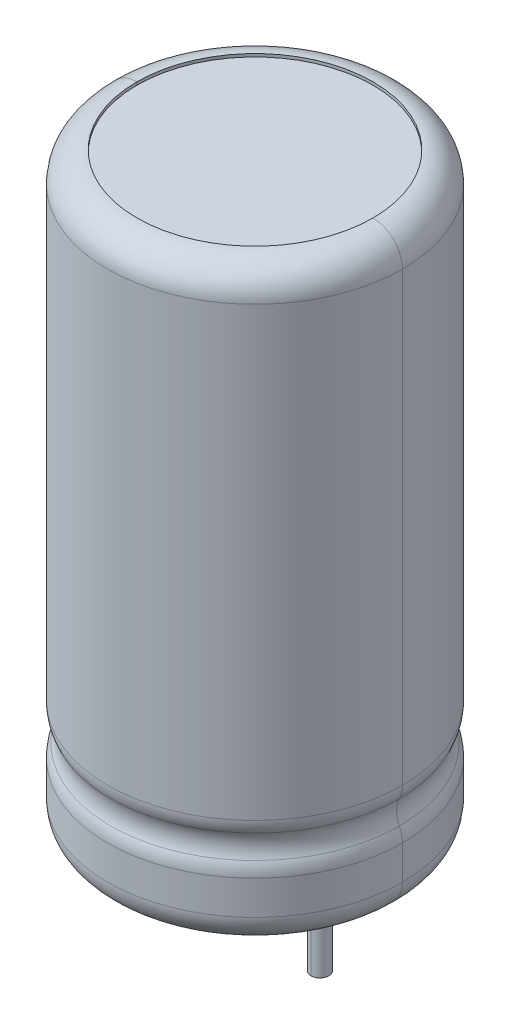
ISO-10303-21;
HEADER;
FILE_DESCRIPTION(('STEP AP214'),'2;1');
FILE_NAME('part.step','',(''),(''),'','','');
FILE_SCHEMA(('AUTOMOTIVE_DESIGN { 1 0 10303 214 1 1 1 1 }'));
ENDSEC;
DATA;
#1=APPLICATION_CONTEXT('core data for automotive mechanical design processes');
#2=APPLICATION_PROTOCOL_DEFINITION('international standard','automotive_design',2000,#1);
#3=PRODUCT_CONTEXT('',#1,'mechanical');
#4=PRODUCT('Part','Part','',(#3));
#5=PRODUCT_RELATED_PRODUCT_CATEGORY('part','',(#4));
#6=PRODUCT_DEFINITION_FORMATION('','',#4);
#7=PRODUCT_DEFINITION_CONTEXT('part definition',#1,'design');
#8=PRODUCT_DEFINITION('design','',#6,#7);
#9=PRODUCT_DEFINITION_SHAPE('','',#8);
#10=(LENGTH_UNIT() NAMED_UNIT(*) SI_UNIT(.MILLI.,.METRE.));
#11=(NAMED_UNIT(*) PLANE_ANGLE_UNIT() SI_UNIT($,.RADIAN.));
#12=(NAMED_UNIT(*) SI_UNIT($,.STERADIAN.) SOLID_ANGLE_UNIT());
#13=UNCERTAINTY_MEASURE_WITH_UNIT(LENGTH_MEASURE(1.E-05),#10,'distance_accuracy_value','');
#14=(GEOMETRIC_REPRESENTATION_CONTEXT(3) GLOBAL_UNCERTAINTY_ASSIGNED_CONTEXT((#13)) GLOBAL_UNIT_ASSIGNED_CONTEXT((#10,
#11,#12)) REPRESENTATION_CONTEXT('',''));
#15=CARTESIAN_POINT('',(0.,0.,0.));
#16=DIRECTION('',(0.,0.,1.));
#17=DIRECTION('',(1.,0.,0.));
#18=AXIS2_PLACEMENT_3D('',#15,#16,#17);
#19=CARTESIAN_POINT('',(2.2,0.,0.));
#20=DIRECTION('',(0.,-1.,0.));
#21=DIRECTION('',(0.,0.,1.));
#22=AXIS2_PLACEMENT_3D('',#19,#20,#21);
#23=CYLINDRICAL_SURFACE('',#22,0.3);
#24=CARTESIAN_POINT('',(2.2,-3.,0.));
#25=DIRECTION('',(0.,-1.,0.));
#26=DIRECTION('',(0.,0.,-1.));
#27=AXIS2_PLACEMENT_3D('',#24,#25,#26);
#28=CIRCLE('',#27,0.3);
#29=CARTESIAN_POINT('',(2.2,-3.,-0.3));
#30=VERTEX_POINT('',#29);
#31=CARTESIAN_POINT('',(2.2,-3.,0.3));
#32=VERTEX_POINT('',#31);
#33=EDGE_CURVE('E249',#30,#32,#28,.T.);
#34=ORIENTED_EDGE('',*,*,#33,.F.);
#35=DIRECTION('',(0.,-1.,0.));
#36=VECTOR('',#35,1.);
#37=CARTESIAN_POINT('',(2.2,0.,-0.3));
#38=LINE('',#37,#36);
#39=CARTESIAN_POINT('',(2.2,0.,-0.3));
#40=VERTEX_POINT('',#39);
#41=EDGE_CURVE('E11',#40,#30,#38,.T.);
#42=ORIENTED_EDGE('',*,*,#41,.F.);
#43=CARTESIAN_POINT('',(2.2,0.,0.));
#44=DIRECTION('',(0.,-1.,0.));
#45=DIRECTION('',(0.,0.,-1.));
#46=AXIS2_PLACEMENT_3D('',#43,#44,#45);
#47=CIRCLE('',#46,0.3);
#48=CARTESIAN_POINT('',(2.5,0.,0.));
#49=VERTEX_POINT('',#48);
#50=EDGE_CURVE('E27',#40,#49,#47,.T.);
#51=ORIENTED_EDGE('',*,*,#50,.T.);
#52=DIRECTION('',(0.,1.,0.));
#53=VECTOR('',#52,1.);
#54=CARTESIAN_POINT('',(2.5,0.,0.));
#55=LINE('',#54,#53);
#56=CARTESIAN_POINT('',(2.5,0.1,0.));
#57=VERTEX_POINT('',#56);
#58=EDGE_CURVE('E171',#49,#57,#55,.T.);
#59=ORIENTED_EDGE('',*,*,#58,.T.);
#60=CARTESIAN_POINT('',(2.2,0.1,0.));
#61=DIRECTION('',(0.,1.,0.));
#62=DIRECTION('',(-1.,0.,0.));
#63=AXIS2_PLACEMENT_3D('',#60,#61,#62);
#64=CIRCLE('',#63,0.3);
#65=CARTESIAN_POINT('',(1.9,0.1,0.));
#66=VERTEX_POINT('',#65);
#67=EDGE_CURVE('E214',#66,#57,#64,.T.);
#68=ORIENTED_EDGE('',*,*,#67,.F.);
#69=DIRECTION('',(0.,1.,0.));
#70=VECTOR('',#69,1.);
#71=CARTESIAN_POINT('',(1.9,0.,0.));
#72=LINE('',#71,#70);
#73=CARTESIAN_POINT('',(1.9,0.,0.));
#74=VERTEX_POINT('',#73);
#75=EDGE_CURVE('E254',#74,#66,#72,.T.);
#76=ORIENTED_EDGE('',*,*,#75,.F.);
#77=CARTESIAN_POINT('',(2.2,0.,0.));
#78=DIRECTION('',(0.,-1.,0.));
#79=DIRECTION('',(0.,0.,1.));
#80=AXIS2_PLACEMENT_3D('',#77,#78,#79);
#81=CIRCLE('',#80,0.3);
#82=CARTESIAN_POINT('',(2.2,0.,0.3));
#83=VERTEX_POINT('',#82);
#84=EDGE_CURVE('E250',#83,#74,#81,.T.);
#85=ORIENTED_EDGE('',*,*,#84,.F.);
#86=DIRECTION('',(0.,-1.,0.));
#87=VECTOR('',#86,1.);
#88=CARTESIAN_POINT('',(2.2,0.,0.3));
#89=LINE('',#88,#87);
#90=EDGE_CURVE('E229',#83,#32,#89,.T.);
#91=ORIENTED_EDGE('',*,*,#90,.T.);
#92=EDGE_LOOP('',(#34,#42,#51,#59,#68,#76,#85,#91));
#93=FACE_BOUND('',#92,.T.);
#94=ADVANCED_FACE('F16',(#93),#23,.T.);
#95=CARTESIAN_POINT('',(2.2,0.,0.));
#96=DIRECTION('',(0.,-1.,0.));
#97=DIRECTION('',(0.,0.,1.));
#98=AXIS2_PLACEMENT_3D('',#95,#96,#97);
#99=CYLINDRICAL_SURFACE('',#98,0.3);
#100=CARTESIAN_POINT('',(2.2,-3.,0.));
#101=DIRECTION('',(0.,-1.,0.));
#102=DIRECTION('',(0.,0.,1.));
#103=AXIS2_PLACEMENT_3D('',#100,#101,#102);
#104=CIRCLE('',#103,0.3);
#105=EDGE_CURVE('E245',#32,#30,#104,.T.);
#106=ORIENTED_EDGE('',*,*,#105,.F.);
#107=ORIENTED_EDGE('',*,*,#90,.F.);
#108=ORIENTED_EDGE('',*,*,#84,.T.);
#109=ORIENTED_EDGE('',*,*,#75,.T.);
#110=CARTESIAN_POINT('',(2.2,0.1,0.));
#111=DIRECTION('',(0.,1.,0.));
#112=DIRECTION('',(1.,0.,0.));
#113=AXIS2_PLACEMENT_3D('',#110,#111,#112);
#114=CIRCLE('',#113,0.3);
#115=EDGE_CURVE('E288',#57,#66,#114,.T.);
#116=ORIENTED_EDGE('',*,*,#115,.F.);
#117=ORIENTED_EDGE('',*,*,#58,.F.);
#118=ORIENTED_EDGE('',*,*,#50,.F.);
#119=ORIENTED_EDGE('',*,*,#41,.T.);
#120=EDGE_LOOP('',(#106,#107,#108,#109,#116,#117,#118,#119));
#121=FACE_BOUND('',#120,.T.);
#122=ADVANCED_FACE('F429',(#121),#99,.T.);
#123=CARTESIAN_POINT('',(0.,-3.,0.));
#124=DIRECTION('',(0.,-1.,0.));
#125=DIRECTION('',(0.,0.,-1.));
#126=AXIS2_PLACEMENT_3D('',#123,#124,#125);
#127=PLANE('',#126);
#128=CARTESIAN_POINT('',(-2.2,-3.,0.));
#129=DIRECTION('',(0.,-1.,0.));
#130=DIRECTION('',(0.,0.,-1.));
#131=AXIS2_PLACEMENT_3D('',#128,#129,#130);
#132=CIRCLE('',#131,0.3);
#133=CARTESIAN_POINT('',(-2.2,-3.,-0.3));
#134=VERTEX_POINT('',#133);
#135=CARTESIAN_POINT('',(-2.2,-3.,0.3));
#136=VERTEX_POINT('',#135);
#137=EDGE_CURVE('E161',#134,#136,#132,.T.);
#138=ORIENTED_EDGE('',*,*,#137,.T.);
#139=CARTESIAN_POINT('',(-2.2,-3.,0.));
#140=DIRECTION('',(0.,-1.,0.));
#141=DIRECTION('',(0.,0.,1.));
#142=AXIS2_PLACEMENT_3D('',#139,#140,#141);
#143=CIRCLE('',#142,0.3);
#144=EDGE_CURVE('E232',#136,#134,#143,.T.);
#145=ORIENTED_EDGE('',*,*,#144,.T.);
#146=EDGE_LOOP('',(#138,#145));
#147=FACE_BOUND('',#146,.T.);
#148=ADVANCED_FACE('F439',(#147),#127,.T.);
#149=CARTESIAN_POINT('',(0.,-3.,0.));
#150=DIRECTION('',(0.,-1.,0.));
#151=DIRECTION('',(0.,0.,-1.));
#152=AXIS2_PLACEMENT_3D('',#149,#150,#151);
#153=PLANE('',#152);
#154=ORIENTED_EDGE('',*,*,#33,.T.);
#155=ORIENTED_EDGE('',*,*,#105,.T.);
#156=EDGE_LOOP('',(#154,#155));
#157=FACE_BOUND('',#156,.T.);
#158=ADVANCED_FACE('F444',(#157),#153,.T.);
#159=CARTESIAN_POINT('',(-2.2,0.,0.));
#160=DIRECTION('',(0.,-1.,0.));
#161=DIRECTION('',(0.,0.,1.));
#162=AXIS2_PLACEMENT_3D('',#159,#160,#161);
#163=CYLINDRICAL_SURFACE('',#162,0.3);
#164=ORIENTED_EDGE('',*,*,#137,.F.);
#165=DIRECTION('',(0.,-1.,0.));
#166=VECTOR('',#165,1.);
#167=CARTESIAN_POINT('',(-2.2,0.,-0.3));
#168=LINE('',#167,#166);
#169=CARTESIAN_POINT('',(-2.2,0.,-0.3));
#170=VERTEX_POINT('',#169);
#171=EDGE_CURVE('E340',#170,#134,#168,.T.);
#172=ORIENTED_EDGE('',*,*,#171,.F.);
#173=CARTESIAN_POINT('',(-2.2,0.,0.));
#174=DIRECTION('',(0.,-1.,0.));
#175=DIRECTION('',(0.,0.,-1.));
#176=AXIS2_PLACEMENT_3D('',#173,#174,#175);
#177=CIRCLE('',#176,0.3);
#178=CARTESIAN_POINT('',(-1.9,0.,0.));
#179=VERTEX_POINT('',#178);
#180=EDGE_CURVE('E337',#170,#179,#177,.T.);
#181=ORIENTED_EDGE('',*,*,#180,.T.);
#182=DIRECTION('',(0.,1.,0.));
#183=VECTOR('',#182,1.);
#184=CARTESIAN_POINT('',(-1.9,0.,0.));
#185=LINE('',#184,#183);
#186=CARTESIAN_POINT('',(-1.9,0.1,0.));
#187=VERTEX_POINT('',#186);
#188=EDGE_CURVE('E207',#179,#187,#185,.T.);
#189=ORIENTED_EDGE('',*,*,#188,.T.);
#190=CARTESIAN_POINT('',(-2.2,0.1,0.));
#191=DIRECTION('',(0.,1.,0.));
#192=DIRECTION('',(-1.,0.,0.));
#193=AXIS2_PLACEMENT_3D('',#190,#191,#192);
#194=CIRCLE('',#193,0.3);
#195=CARTESIAN_POINT('',(-2.5,0.1,0.));
#196=VERTEX_POINT('',#195);
#197=EDGE_CURVE('E212',#196,#187,#194,.T.);
#198=ORIENTED_EDGE('',*,*,#197,.F.);
#199=DIRECTION('',(0.,1.,0.));
#200=VECTOR('',#199,1.);
#201=CARTESIAN_POINT('',(-2.5,0.,0.));
#202=LINE('',#201,#200);
#203=CARTESIAN_POINT('',(-2.5,0.,0.));
#204=VERTEX_POINT('',#203);
#205=EDGE_CURVE('E195',#204,#196,#202,.T.);
#206=ORIENTED_EDGE('',*,*,#205,.F.);
#207=CARTESIAN_POINT('',(-2.2,0.,0.));
#208=DIRECTION('',(0.,-1.,0.));
#209=DIRECTION('',(0.,0.,1.));
#210=AXIS2_PLACEMENT_3D('',#207,#208,#209);
#211=CIRCLE('',#210,0.3);
#212=CARTESIAN_POINT('',(-2.2,0.,0.3));
#213=VERTEX_POINT('',#212);
#214=EDGE_CURVE('E203',#213,#204,#211,.T.);
#215=ORIENTED_EDGE('',*,*,#214,.F.);
#216=DIRECTION('',(0.,-1.,0.));
#217=VECTOR('',#216,1.);
#218=CARTESIAN_POINT('',(-2.2,0.,0.3));
#219=LINE('',#218,#217);
#220=EDGE_CURVE('E230',#213,#136,#219,.T.);
#221=ORIENTED_EDGE('',*,*,#220,.T.);
#222=EDGE_LOOP('',(#164,#172,#181,#189,#198,#206,#215,#221));
#223=FACE_BOUND('',#222,.T.);
#224=ADVANCED_FACE('F216',(#223),#163,.T.);
#225=CARTESIAN_POINT('',(-2.2,0.,0.));
#226=DIRECTION('',(0.,-1.,0.));
#227=DIRECTION('',(0.,0.,1.));
#228=AXIS2_PLACEMENT_3D('',#225,#226,#227);
#229=CYLINDRICAL_SURFACE('',#228,0.3);
#230=ORIENTED_EDGE('',*,*,#144,.F.);
#231=ORIENTED_EDGE('',*,*,#220,.F.);
#232=ORIENTED_EDGE('',*,*,#214,.T.);
#233=ORIENTED_EDGE('',*,*,#205,.T.);
#234=CARTESIAN_POINT('',(-2.2,0.1,0.));
#235=DIRECTION('',(0.,1.,0.));
#236=DIRECTION('',(1.,0.,0.));
#237=AXIS2_PLACEMENT_3D('',#234,#235,#236);
#238=CIRCLE('',#237,0.3);
#239=EDGE_CURVE('E200',#187,#196,#238,.T.);
#240=ORIENTED_EDGE('',*,*,#239,.F.);
#241=ORIENTED_EDGE('',*,*,#188,.F.);
#242=ORIENTED_EDGE('',*,*,#180,.F.);
#243=ORIENTED_EDGE('',*,*,#171,.T.);
#244=EDGE_LOOP('',(#230,#231,#232,#233,#240,#241,#242,#243));
#245=FACE_BOUND('',#244,.T.);
#246=ADVANCED_FACE('F198',(#245),#229,.T.);
#247=CARTESIAN_POINT('',(0.,0.1,0.));
#248=DIRECTION('',(0.,-1.,0.));
#249=DIRECTION('',(0.,0.,-1.));
#250=AXIS2_PLACEMENT_3D('',#247,#248,#249);
#251=PLANE('',#250);
#252=ORIENTED_EDGE('',*,*,#67,.T.);
#253=ORIENTED_EDGE('',*,*,#115,.T.);
#254=EDGE_LOOP('',(#252,#253));
#255=FACE_BOUND('',#254,.T.);
#256=ORIENTED_EDGE('',*,*,#197,.T.);
#257=ORIENTED_EDGE('',*,*,#239,.T.);
#258=EDGE_LOOP('',(#256,#257));
#259=FACE_BOUND('',#258,.T.);
#260=CARTESIAN_POINT('',(0.,0.1,0.));
#261=DIRECTION('',(0.,-1.,0.));
#262=DIRECTION('',(-1.,0.,0.));
#263=AXIS2_PLACEMENT_3D('',#260,#261,#262);
#264=CIRCLE('',#263,4.);
#265=CARTESIAN_POINT('',(-4.,0.1,0.));
#266=VERTEX_POINT('',#265);
#267=CARTESIAN_POINT('',(4.,0.1,0.));
#268=VERTEX_POINT('',#267);
#269=EDGE_CURVE('E225',#266,#268,#264,.T.);
#270=ORIENTED_EDGE('',*,*,#269,.T.);
#271=CARTESIAN_POINT('',(0.,0.1,0.));
#272=DIRECTION('',(0.,-1.,0.));
#273=DIRECTION('',(1.,0.,0.));
#274=AXIS2_PLACEMENT_3D('',#271,#272,#273);
#275=CIRCLE('',#274,4.);
#276=EDGE_CURVE('E270',#268,#266,#275,.T.);
#277=ORIENTED_EDGE('',*,*,#276,.T.);
#278=EDGE_LOOP('',(#270,#277));
#279=FACE_BOUND('',#278,.T.);
#280=ADVANCED_FACE('F210',(#255,#259,#279),#251,.T.);
#281=CARTESIAN_POINT('',(0.,1.,0.));
#282=DIRECTION('',(0.,1.,0.));
#283=DIRECTION('',(-0.999930438942627,0.,0.0117947986844103));
#284=AXIS2_PLACEMENT_3D('',#281,#282,#283);
#285=TOROIDAL_SURFACE('',#284,4.,1.);
#286=CARTESIAN_POINT('',(-4.,1.,0.));
#287=DIRECTION('',(0.,0.,-1.));
#288=DIRECTION('',(0.,-1.,0.));
#289=AXIS2_PLACEMENT_3D('',#286,#287,#288);
#290=CIRCLE('',#289,1.);
#291=CARTESIAN_POINT('',(-4.,0.,0.));
#292=VERTEX_POINT('',#291);
#293=CARTESIAN_POINT('',(-5.,1.,0.));
#294=VERTEX_POINT('',#293);
#295=EDGE_CURVE('E239',#292,#294,#290,.T.);
#296=ORIENTED_EDGE('',*,*,#295,.T.);
#297=CARTESIAN_POINT('',(0.,1.,0.));
#298=DIRECTION('',(0.,-1.,0.));
#299=DIRECTION('',(-1.,0.,0.));
#300=AXIS2_PLACEMENT_3D('',#297,#298,#299);
#301=CIRCLE('',#300,5.);
#302=CARTESIAN_POINT('',(5.,1.,0.));
#303=VERTEX_POINT('',#302);
#304=EDGE_CURVE('E324',#294,#303,#301,.T.);
#305=ORIENTED_EDGE('',*,*,#304,.T.);
#306=CARTESIAN_POINT('',(4.,1.,0.));
#307=DIRECTION('',(0.,0.,1.));
#308=DIRECTION('',(0.,-1.,0.));
#309=AXIS2_PLACEMENT_3D('',#306,#307,#308);
#310=CIRCLE('',#309,1.);
#311=CARTESIAN_POINT('',(4.,0.,0.));
#312=VERTEX_POINT('',#311);
#313=EDGE_CURVE('E244',#312,#303,#310,.T.);
#314=ORIENTED_EDGE('',*,*,#313,.F.);
#315=CARTESIAN_POINT('',(0.,0.,0.));
#316=DIRECTION('',(0.,-1.,0.));
#317=DIRECTION('',(-1.,0.,0.));
#318=AXIS2_PLACEMENT_3D('',#315,#316,#317);
#319=CIRCLE('',#318,4.);
#320=EDGE_CURVE('E218',#292,#312,#319,.T.);
#321=ORIENTED_EDGE('',*,*,#320,.F.);
#322=EDGE_LOOP('',(#296,#305,#314,#321));
#323=FACE_BOUND('',#322,.T.);
#324=ADVANCED_FACE('F458',(#323),#285,.T.);
#325=CARTESIAN_POINT('',(0.,0.,0.));
#326=DIRECTION('',(0.,-1.,0.));
#327=DIRECTION('',(1.,0.,0.));
#328=AXIS2_PLACEMENT_3D('',#325,#326,#327);
#329=CYLINDRICAL_SURFACE('',#328,4.);
#330=ORIENTED_EDGE('',*,*,#269,.F.);
#331=DIRECTION('',(0.,1.,0.));
#332=VECTOR('',#331,1.);
#333=CARTESIAN_POINT('',(-4.,0.,0.));
#334=LINE('',#333,#332);
#335=EDGE_CURVE('E275',#292,#266,#334,.T.);
#336=ORIENTED_EDGE('',*,*,#335,.F.);
#337=ORIENTED_EDGE('',*,*,#320,.T.);
#338=DIRECTION('',(0.,1.,0.));
#339=VECTOR('',#338,1.);
#340=CARTESIAN_POINT('',(4.,0.,0.));
#341=LINE('',#340,#339);
#342=EDGE_CURVE('E274',#312,#268,#341,.T.);
#343=ORIENTED_EDGE('',*,*,#342,.T.);
#344=EDGE_LOOP('',(#330,#336,#337,#343));
#345=FACE_BOUND('',#344,.T.);
#346=ADVANCED_FACE('F461',(#345),#329,.F.);
#347=CARTESIAN_POINT('',(0.,0.,0.));
#348=DIRECTION('',(0.,-1.,0.));
#349=DIRECTION('',(1.,0.,0.));
#350=AXIS2_PLACEMENT_3D('',#347,#348,#349);
#351=CYLINDRICAL_SURFACE('',#350,4.);
#352=CARTESIAN_POINT('',(0.,0.,0.));
#353=DIRECTION('',(0.,-1.,0.));
#354=DIRECTION('',(1.,0.,0.));
#355=AXIS2_PLACEMENT_3D('',#352,#353,#354);
#356=CIRCLE('',#355,4.);
#357=EDGE_CURVE('E243',#312,#292,#356,.T.);
#358=ORIENTED_EDGE('',*,*,#357,.T.);
#359=ORIENTED_EDGE('',*,*,#335,.T.);
#360=ORIENTED_EDGE('',*,*,#276,.F.);
#361=ORIENTED_EDGE('',*,*,#342,.F.);
#362=EDGE_LOOP('',(#358,#359,#360,#361));
#363=FACE_BOUND('',#362,.T.);
#364=ADVANCED_FACE('F18',(#363),#351,.F.);
#365=CARTESIAN_POINT('',(0.,1.,0.));
#366=DIRECTION('',(0.,1.,0.));
#367=DIRECTION('',(0.999930438942627,0.,-0.0117947986844103));
#368=AXIS2_PLACEMENT_3D('',#365,#366,#367);
#369=TOROIDAL_SURFACE('',#368,4.,1.);
#370=ORIENTED_EDGE('',*,*,#313,.T.);
#371=CARTESIAN_POINT('',(0.,1.,0.));
#372=DIRECTION('',(0.,-1.,0.));
#373=DIRECTION('',(1.,0.,0.));
#374=AXIS2_PLACEMENT_3D('',#371,#372,#373);
#375=CIRCLE('',#374,5.);
#376=EDGE_CURVE('E282',#303,#294,#375,.T.);
#377=ORIENTED_EDGE('',*,*,#376,.T.);
#378=ORIENTED_EDGE('',*,*,#295,.F.);
#379=ORIENTED_EDGE('',*,*,#357,.F.);
#380=EDGE_LOOP('',(#370,#377,#378,#379));
#381=FACE_BOUND('',#380,.T.);
#382=ADVANCED_FACE('F480',(#381),#369,.T.);
#383=CARTESIAN_POINT('',(0.,3.,0.));
#384=DIRECTION('',(0.,-1.,0.));
#385=DIRECTION('',(-1.,0.,0.));
#386=AXIS2_PLACEMENT_3D('',#383,#384,#385);
#387=TOROIDAL_SURFACE('',#386,5.7,0.9);
#388=CARTESIAN_POINT('',(-5.7,3.,0.));
#389=DIRECTION('',(0.,0.,-1.));
#390=DIRECTION('',(0.894736842105259,0.44659375653888,0.));
#391=AXIS2_PLACEMENT_3D('',#388,#389,#390);
#392=CIRCLE('',#391,0.9);
#393=CARTESIAN_POINT('',(-4.894736842105,3.401934380885,0.));
#394=VERTEX_POINT('',#393);
#395=CARTESIAN_POINT('',(-4.894736842105,2.598065619115,0.));
#396=VERTEX_POINT('',#395);
#397=EDGE_CURVE('E261',#394,#396,#392,.T.);
#398=ORIENTED_EDGE('',*,*,#397,.T.);
#399=CARTESIAN_POINT('',(0.,2.598065619115,0.));
#400=DIRECTION('',(0.,-1.,0.));
#401=DIRECTION('',(1.,0.,0.));
#402=AXIS2_PLACEMENT_3D('',#399,#400,#401);
#403=CIRCLE('',#402,4.894736842105);
#404=CARTESIAN_POINT('',(4.894736842105,2.598065619115,0.));
#405=VERTEX_POINT('',#404);
#406=EDGE_CURVE('E297',#405,#396,#403,.T.);
#407=ORIENTED_EDGE('',*,*,#406,.F.);
#408=CARTESIAN_POINT('',(5.7,3.,0.));
#409=DIRECTION('',(0.,0.,-1.));
#410=DIRECTION('',(-0.894736842105259,-0.44659375653888,0.));
#411=AXIS2_PLACEMENT_3D('',#408,#409,#410);
#412=CIRCLE('',#411,0.9);
#413=CARTESIAN_POINT('',(4.894736842105,3.401934380885,0.));
#414=VERTEX_POINT('',#413);
#415=EDGE_CURVE('E264',#405,#414,#412,.T.);
#416=ORIENTED_EDGE('',*,*,#415,.T.);
#417=CARTESIAN_POINT('',(0.,3.401934380885,0.));
#418=DIRECTION('',(0.,1.,0.));
#419=DIRECTION('',(-1.,0.,0.));
#420=AXIS2_PLACEMENT_3D('',#417,#418,#419);
#421=CIRCLE('',#420,4.894736842105);
#422=EDGE_CURVE('E353',#394,#414,#421,.T.);
#423=ORIENTED_EDGE('',*,*,#422,.F.);
#424=EDGE_LOOP('',(#398,#407,#416,#423));
#425=FACE_BOUND('',#424,.T.);
#426=ADVANCED_FACE('F404',(#425),#387,.F.);
#427=CARTESIAN_POINT('',(0.,3.,0.));
#428=DIRECTION('',(0.,-1.,0.));
#429=DIRECTION('',(-1.,0.,0.));
#430=AXIS2_PLACEMENT_3D('',#427,#428,#429);
#431=TOROIDAL_SURFACE('',#430,5.7,0.9);
#432=ORIENTED_EDGE('',*,*,#415,.F.);
#433=CARTESIAN_POINT('',(0.,2.598065619115,0.));
#434=DIRECTION('',(0.,-1.,0.));
#435=DIRECTION('',(-1.,0.,0.));
#436=AXIS2_PLACEMENT_3D('',#433,#434,#435);
#437=CIRCLE('',#436,4.894736842105);
#438=EDGE_CURVE('E296',#396,#405,#437,.T.);
#439=ORIENTED_EDGE('',*,*,#438,.F.);
#440=ORIENTED_EDGE('',*,*,#397,.F.);
#441=CARTESIAN_POINT('',(0.,3.401934380885,0.));
#442=DIRECTION('',(0.,1.,0.));
#443=DIRECTION('',(1.,0.,0.));
#444=AXIS2_PLACEMENT_3D('',#441,#442,#443);
#445=CIRCLE('',#444,4.894736842105);
#446=EDGE_CURVE('E237',#414,#394,#445,.T.);
#447=ORIENTED_EDGE('',*,*,#446,.F.);
#448=EDGE_LOOP('',(#432,#439,#440,#447));
#449=FACE_BOUND('',#448,.T.);
#450=ADVANCED_FACE('F399',(#449),#431,.F.);
#451=CARTESIAN_POINT('',(0.,2.151471862576,0.));
#452=DIRECTION('',(0.,1.,0.));
#453=DIRECTION('',(-0.999968130527131,0.,0.00798360382751725));
#454=AXIS2_PLACEMENT_3D('',#451,#452,#453);
#455=TOROIDAL_SURFACE('',#454,4.,1.);
#456=CARTESIAN_POINT('',(-4.,2.151471862576,4.946749260215E-11));
#457=DIRECTION('',(-1.236687315054E-11,0.,-1.));
#458=DIRECTION('',(-1.,0.,1.236687315054E-11));
#459=AXIS2_PLACEMENT_3D('',#456,#457,#458);
#460=CIRCLE('',#459,1.);
#461=CARTESIAN_POINT('',(-5.,2.151471862576,0.));
#462=VERTEX_POINT('',#461);
#463=EDGE_CURVE('E292',#462,#396,#460,.T.);
#464=ORIENTED_EDGE('',*,*,#463,.T.);
#465=ORIENTED_EDGE('',*,*,#438,.T.);
#466=CARTESIAN_POINT('',(4.,2.151471862576,-4.946699994068E-11));
#467=DIRECTION('',(1.236674998517E-11,0.,1.));
#468=DIRECTION('',(1.,0.,-1.236674998517E-11));
#469=AXIS2_PLACEMENT_3D('',#466,#467,#468);
#470=CIRCLE('',#469,1.);
#471=CARTESIAN_POINT('',(5.,2.151471862576,0.));
#472=VERTEX_POINT('',#471);
#473=EDGE_CURVE('E301',#472,#405,#470,.T.);
#474=ORIENTED_EDGE('',*,*,#473,.F.);
#475=CARTESIAN_POINT('',(0.,2.151471862576,0.));
#476=DIRECTION('',(0.,-1.,0.));
#477=DIRECTION('',(-1.,0.,0.));
#478=AXIS2_PLACEMENT_3D('',#475,#476,#477);
#479=CIRCLE('',#478,5.);
#480=EDGE_CURVE('E238',#462,#472,#479,.T.);
#481=ORIENTED_EDGE('',*,*,#480,.F.);
#482=EDGE_LOOP('',(#464,#465,#474,#481));
#483=FACE_BOUND('',#482,.T.);
#484=ADVANCED_FACE('F456',(#483),#455,.T.);
#485=CARTESIAN_POINT('',(0.,2.151471862576,0.));
#486=DIRECTION('',(0.,1.,0.));
#487=DIRECTION('',(0.999968130527131,0.,-0.00798360382751725));
#488=AXIS2_PLACEMENT_3D('',#485,#486,#487);
#489=TOROIDAL_SURFACE('',#488,4.,1.);
#490=ORIENTED_EDGE('',*,*,#473,.T.);
#491=ORIENTED_EDGE('',*,*,#406,.T.);
#492=ORIENTED_EDGE('',*,*,#463,.F.);
#493=CARTESIAN_POINT('',(0.,2.151471862576,0.));
#494=DIRECTION('',(0.,-1.,0.));
#495=DIRECTION('',(1.,0.,0.));
#496=AXIS2_PLACEMENT_3D('',#493,#494,#495);
#497=CIRCLE('',#496,5.);
#498=EDGE_CURVE('E20',#472,#462,#497,.T.);
#499=ORIENTED_EDGE('',*,*,#498,.F.);
#500=EDGE_LOOP('',(#490,#491,#492,#499));
#501=FACE_BOUND('',#500,.T.);
#502=ADVANCED_FACE('F452',(#501),#489,.T.);
#503=CARTESIAN_POINT('',(0.,19.9,0.));
#504=DIRECTION('',(0.,1.,0.));
#505=DIRECTION('',(1.,0.,0.));
#506=AXIS2_PLACEMENT_3D('',#503,#504,#505);
#507=PLANE('',#506);
#508=CARTESIAN_POINT('',(0.,19.9,0.));
#509=DIRECTION('',(0.,1.,0.));
#510=DIRECTION('',(1.,0.,0.));
#511=AXIS2_PLACEMENT_3D('',#508,#509,#510);
#512=CIRCLE('',#511,4.);
#513=CARTESIAN_POINT('',(4.,19.9,0.));
#514=VERTEX_POINT('',#513);
#515=CARTESIAN_POINT('',(-4.,19.9,0.));
#516=VERTEX_POINT('',#515);
#517=EDGE_CURVE('E123',#514,#516,#512,.T.);
#518=ORIENTED_EDGE('',*,*,#517,.T.);
#519=CARTESIAN_POINT('',(0.,19.9,0.));
#520=DIRECTION('',(0.,1.,0.));
#521=DIRECTION('',(-1.,0.,0.));
#522=AXIS2_PLACEMENT_3D('',#519,#520,#521);
#523=CIRCLE('',#522,4.);
#524=EDGE_CURVE('E284',#516,#514,#523,.T.);
#525=ORIENTED_EDGE('',*,*,#524,.T.);
#526=EDGE_LOOP('',(#518,#525));
#527=FACE_BOUND('',#526,.T.);
#528=ADVANCED_FACE('F448',(#527),#507,.T.);
#529=CARTESIAN_POINT('',(0.,19.,0.));
#530=DIRECTION('',(0.,1.,0.));
#531=DIRECTION('',(0.999965529132265,0.,0.00830304445542171));
#532=AXIS2_PLACEMENT_3D('',#529,#530,#531);
#533=TOROIDAL_SURFACE('',#532,4.,1.);
#534=CARTESIAN_POINT('',(4.,19.,0.));
#535=DIRECTION('',(0.,0.,-1.));
#536=DIRECTION('',(0.,1.,0.));
#537=AXIS2_PLACEMENT_3D('',#534,#535,#536);
#538=CIRCLE('',#537,1.);
#539=CARTESIAN_POINT('',(4.,20.,0.));
#540=VERTEX_POINT('',#539);
#541=CARTESIAN_POINT('',(5.,19.,0.));
#542=VERTEX_POINT('',#541);
#543=EDGE_CURVE('E258',#540,#542,#538,.T.);
#544=ORIENTED_EDGE('',*,*,#543,.T.);
#545=CARTESIAN_POINT('',(0.,19.,0.));
#546=DIRECTION('',(0.,1.,0.));
#547=DIRECTION('',(1.,0.,0.));
#548=AXIS2_PLACEMENT_3D('',#545,#546,#547);
#549=CIRCLE('',#548,5.);
#550=CARTESIAN_POINT('',(-5.,19.,0.));
#551=VERTEX_POINT('',#550);
#552=EDGE_CURVE('E376',#542,#551,#549,.T.);
#553=ORIENTED_EDGE('',*,*,#552,.T.);
#554=CARTESIAN_POINT('',(-4.,19.,0.));
#555=DIRECTION('',(0.,0.,1.));
#556=DIRECTION('',(0.,1.,0.));
#557=AXIS2_PLACEMENT_3D('',#554,#555,#556);
#558=CIRCLE('',#557,1.);
#559=CARTESIAN_POINT('',(-4.,20.,0.));
#560=VERTEX_POINT('',#559);
#561=EDGE_CURVE('E255',#560,#551,#558,.T.);
#562=ORIENTED_EDGE('',*,*,#561,.F.);
#563=CARTESIAN_POINT('',(0.,20.,0.));
#564=DIRECTION('',(0.,1.,0.));
#565=DIRECTION('',(1.,0.,0.));
#566=AXIS2_PLACEMENT_3D('',#563,#564,#565);
#567=CIRCLE('',#566,4.);
#568=EDGE_CURVE('E136',#540,#560,#567,.T.);
#569=ORIENTED_EDGE('',*,*,#568,.F.);
#570=EDGE_LOOP('',(#544,#553,#562,#569));
#571=FACE_BOUND('',#570,.T.);
#572=ADVANCED_FACE('F451',(#571),#533,.T.);
#573=CARTESIAN_POINT('',(0.,20.,0.));
#574=DIRECTION('',(0.,1.,0.));
#575=DIRECTION('',(-1.,0.,0.));
#576=AXIS2_PLACEMENT_3D('',#573,#574,#575);
#577=CYLINDRICAL_SURFACE('',#576,4.);
#578=ORIENTED_EDGE('',*,*,#517,.F.);
#579=DIRECTION('',(0.,-1.,0.));
#580=VECTOR('',#579,1.);
#581=CARTESIAN_POINT('',(4.,20.,0.));
#582=LINE('',#581,#580);
#583=EDGE_CURVE('E269',#540,#514,#582,.T.);
#584=ORIENTED_EDGE('',*,*,#583,.F.);
#585=ORIENTED_EDGE('',*,*,#568,.T.);
#586=DIRECTION('',(0.,-1.,0.));
#587=VECTOR('',#586,1.);
#588=CARTESIAN_POINT('',(-4.,20.,0.));
#589=LINE('',#588,#587);
#590=EDGE_CURVE('E287',#560,#516,#589,.T.);
#591=ORIENTED_EDGE('',*,*,#590,.T.);
#592=EDGE_LOOP('',(#578,#584,#585,#591));
#593=FACE_BOUND('',#592,.T.);
#594=ADVANCED_FACE('F472',(#593),#577,.F.);
#595=CARTESIAN_POINT('',(0.,20.,0.));
#596=DIRECTION('',(0.,1.,0.));
#597=DIRECTION('',(-1.,0.,0.));
#598=AXIS2_PLACEMENT_3D('',#595,#596,#597);
#599=CYLINDRICAL_SURFACE('',#598,4.);
#600=CARTESIAN_POINT('',(0.,20.,0.));
#601=DIRECTION('',(0.,1.,0.));
#602=DIRECTION('',(-1.,0.,0.));
#603=AXIS2_PLACEMENT_3D('',#600,#601,#602);
#604=CIRCLE('',#603,4.);
#605=EDGE_CURVE('E265',#560,#540,#604,.T.);
#606=ORIENTED_EDGE('',*,*,#605,.T.);
#607=ORIENTED_EDGE('',*,*,#583,.T.);
#608=ORIENTED_EDGE('',*,*,#524,.F.);
#609=ORIENTED_EDGE('',*,*,#590,.F.);
#610=EDGE_LOOP('',(#606,#607,#608,#609));
#611=FACE_BOUND('',#610,.T.);
#612=ADVANCED_FACE('F526',(#611),#599,.F.);
#613=CARTESIAN_POINT('',(0.,19.,0.));
#614=DIRECTION('',(0.,1.,0.));
#615=DIRECTION('',(-0.999965529132265,0.,-0.00830304445542171));
#616=AXIS2_PLACEMENT_3D('',#613,#614,#615);
#617=TOROIDAL_SURFACE('',#616,4.,1.);
#618=ORIENTED_EDGE('',*,*,#561,.T.);
#619=CARTESIAN_POINT('',(0.,19.,0.));
#620=DIRECTION('',(0.,1.,0.));
#621=DIRECTION('',(-1.,0.,0.));
#622=AXIS2_PLACEMENT_3D('',#619,#620,#621);
#623=CIRCLE('',#622,5.);
#624=EDGE_CURVE('E278',#551,#542,#623,.T.);
#625=ORIENTED_EDGE('',*,*,#624,.T.);
#626=ORIENTED_EDGE('',*,*,#543,.F.);
#627=ORIENTED_EDGE('',*,*,#605,.F.);
#628=EDGE_LOOP('',(#618,#625,#626,#627));
#629=FACE_BOUND('',#628,.T.);
#630=ADVANCED_FACE('F519',(#629),#617,.T.);
#631=CARTESIAN_POINT('',(0.,0.,0.));
#632=DIRECTION('',(0.,1.,0.));
#633=DIRECTION('',(1.,0.,0.));
#634=AXIS2_PLACEMENT_3D('',#631,#632,#633);
#635=CYLINDRICAL_SURFACE('',#634,5.);
#636=DIRECTION('',(0.,1.,-1.958075353175E-12));
#637=VECTOR('',#636,1.);
#638=CARTESIAN_POINT('',(-5.,1.,1.055012864911E-12));
#639=LINE('',#638,#637);
#640=EDGE_CURVE('E348',#294,#462,#639,.T.);
#641=ORIENTED_EDGE('',*,*,#640,.F.);
#642=ORIENTED_EDGE('',*,*,#376,.F.);
#643=DIRECTION('',(0.,1.,1.958659634681E-12));
#644=VECTOR('',#643,1.);
#645=CARTESIAN_POINT('',(5.,1.,-1.055427038637E-12));
#646=LINE('',#645,#644);
#647=EDGE_CURVE('E309',#303,#472,#646,.T.);
#648=ORIENTED_EDGE('',*,*,#647,.T.);
#649=ORIENTED_EDGE('',*,*,#498,.T.);
#650=EDGE_LOOP('',(#641,#642,#648,#649));
#651=FACE_BOUND('',#650,.T.);
#652=ADVANCED_FACE('F483',(#651),#635,.T.);
#653=CARTESIAN_POINT('',(0.,0.,0.));
#654=DIRECTION('',(0.,1.,0.));
#655=DIRECTION('',(1.,0.,0.));
#656=AXIS2_PLACEMENT_3D('',#653,#654,#655);
#657=CYLINDRICAL_SURFACE('',#656,5.);
#658=DIRECTION('',(0.,1.,-1.451486786804E-13));
#659=VECTOR('',#658,1.);
#660=CARTESIAN_POINT('',(5.,3.848528137424,1.214468655583E-12));
#661=LINE('',#660,#659);
#662=CARTESIAN_POINT('',(5.,3.848528137424,0.));
#663=VERTEX_POINT('',#662);
#664=EDGE_CURVE('E310',#663,#542,#661,.T.);
#665=ORIENTED_EDGE('',*,*,#664,.T.);
#666=ORIENTED_EDGE('',*,*,#624,.F.);
#667=DIRECTION('',(0.,1.,1.451205388704E-13));
#668=VECTOR('',#667,1.);
#669=CARTESIAN_POINT('',(-5.,3.848528137424,-1.213648088631E-12));
#670=LINE('',#669,#668);
#671=CARTESIAN_POINT('',(-5.,3.848528137424,0.));
#672=VERTEX_POINT('',#671);
#673=EDGE_CURVE('E414',#672,#551,#670,.T.);
#674=ORIENTED_EDGE('',*,*,#673,.F.);
#675=CARTESIAN_POINT('',(0.,3.848528137424,0.));
#676=DIRECTION('',(0.,1.,0.));
#677=DIRECTION('',(-1.,0.,0.));
#678=AXIS2_PLACEMENT_3D('',#675,#676,#677);
#679=CIRCLE('',#678,5.);
#680=EDGE_CURVE('E283',#672,#663,#679,.T.);
#681=ORIENTED_EDGE('',*,*,#680,.T.);
#682=EDGE_LOOP('',(#665,#666,#674,#681));
#683=FACE_BOUND('',#682,.T.);
#684=ADVANCED_FACE('F409',(#683),#657,.T.);
#685=CARTESIAN_POINT('',(0.,3.848528137424,0.));
#686=DIRECTION('',(0.,1.,0.));
#687=DIRECTION('',(-0.999962124018434,0.,-0.0087034779566393));
#688=AXIS2_PLACEMENT_3D('',#685,#686,#687);
#689=TOROIDAL_SURFACE('',#688,4.,1.);
#690=CARTESIAN_POINT('',(-4.,3.848528137424,-5.326987462251E-11));
#691=DIRECTION('',(-1.331746865563E-11,0.,1.));
#692=DIRECTION('',(-1.,0.,-1.331746865563E-11));
#693=AXIS2_PLACEMENT_3D('',#690,#691,#692);
#694=CIRCLE('',#693,1.);
#695=EDGE_CURVE('E349',#672,#394,#694,.T.);
#696=ORIENTED_EDGE('',*,*,#695,.T.);
#697=ORIENTED_EDGE('',*,*,#422,.T.);
#698=CARTESIAN_POINT('',(4.,3.848528137424,5.326975666131E-11));
#699=DIRECTION('',(1.331743916533E-11,0.,-1.));
#700=DIRECTION('',(1.,0.,1.331743916533E-11));
#701=AXIS2_PLACEMENT_3D('',#698,#699,#700);
#702=CIRCLE('',#701,1.);
#703=EDGE_CURVE('E233',#663,#414,#702,.T.);
#704=ORIENTED_EDGE('',*,*,#703,.F.);
#705=ORIENTED_EDGE('',*,*,#680,.F.);
#706=EDGE_LOOP('',(#696,#697,#704,#705));
#707=FACE_BOUND('',#706,.T.);
#708=ADVANCED_FACE('F406',(#707),#689,.T.);
#709=CARTESIAN_POINT('',(0.,3.848528137424,0.));
#710=DIRECTION('',(0.,1.,0.));
#711=DIRECTION('',(0.999962124018434,0.,0.0087034779566383));
#712=AXIS2_PLACEMENT_3D('',#709,#710,#711);
#713=TOROIDAL_SURFACE('',#712,4.,1.);
#714=ORIENTED_EDGE('',*,*,#703,.T.);
#715=ORIENTED_EDGE('',*,*,#446,.T.);
#716=ORIENTED_EDGE('',*,*,#695,.F.);
#717=CARTESIAN_POINT('',(0.,3.848528137424,0.));
#718=DIRECTION('',(0.,1.,0.));
#719=DIRECTION('',(1.,0.,0.));
#720=AXIS2_PLACEMENT_3D('',#717,#718,#719);
#721=CIRCLE('',#720,5.);
#722=EDGE_CURVE('E305',#663,#672,#721,.T.);
#723=ORIENTED_EDGE('',*,*,#722,.F.);
#724=EDGE_LOOP('',(#714,#715,#716,#723));
#725=FACE_BOUND('',#724,.T.);
#726=ADVANCED_FACE('F395',(#725),#713,.T.);
#727=CARTESIAN_POINT('',(0.,0.,0.));
#728=DIRECTION('',(0.,1.,0.));
#729=DIRECTION('',(1.,0.,0.));
#730=AXIS2_PLACEMENT_3D('',#727,#728,#729);
#731=CYLINDRICAL_SURFACE('',#730,5.);
#732=ORIENTED_EDGE('',*,*,#647,.F.);
#733=ORIENTED_EDGE('',*,*,#304,.F.);
#734=ORIENTED_EDGE('',*,*,#640,.T.);
#735=ORIENTED_EDGE('',*,*,#480,.T.);
#736=EDGE_LOOP('',(#732,#733,#734,#735));
#737=FACE_BOUND('',#736,.T.);
#738=ADVANCED_FACE('F475',(#737),#731,.T.);
#739=CARTESIAN_POINT('',(0.,0.,0.));
#740=DIRECTION('',(0.,1.,0.));
#741=DIRECTION('',(1.,0.,0.));
#742=AXIS2_PLACEMENT_3D('',#739,#740,#741);
#743=CYLINDRICAL_SURFACE('',#742,5.);
#744=ORIENTED_EDGE('',*,*,#673,.T.);
#745=ORIENTED_EDGE('',*,*,#552,.F.);
#746=ORIENTED_EDGE('',*,*,#664,.F.);
#747=ORIENTED_EDGE('',*,*,#722,.T.);
#748=EDGE_LOOP('',(#744,#745,#746,#747));
#749=FACE_BOUND('',#748,.T.);
#750=ADVANCED_FACE('F488',(#749),#743,.T.);
#751=CLOSED_SHELL('',(#94,#122,#148,#158,#224,#246,#280,#324,#346,#364,#382,#426,#450,#484,#502,
#528,#572,#594,#612,#630,#652,#684,#708,#726,#738,#750));
#752=MANIFOLD_SOLID_BREP('B1',#751);
#753=ADVANCED_BREP_SHAPE_REPRESENTATION('',(#18,#752),#14);
#754=SHAPE_DEFINITION_REPRESENTATION(#9,#753);
ENDSEC;
END-ISO-10303-21;
